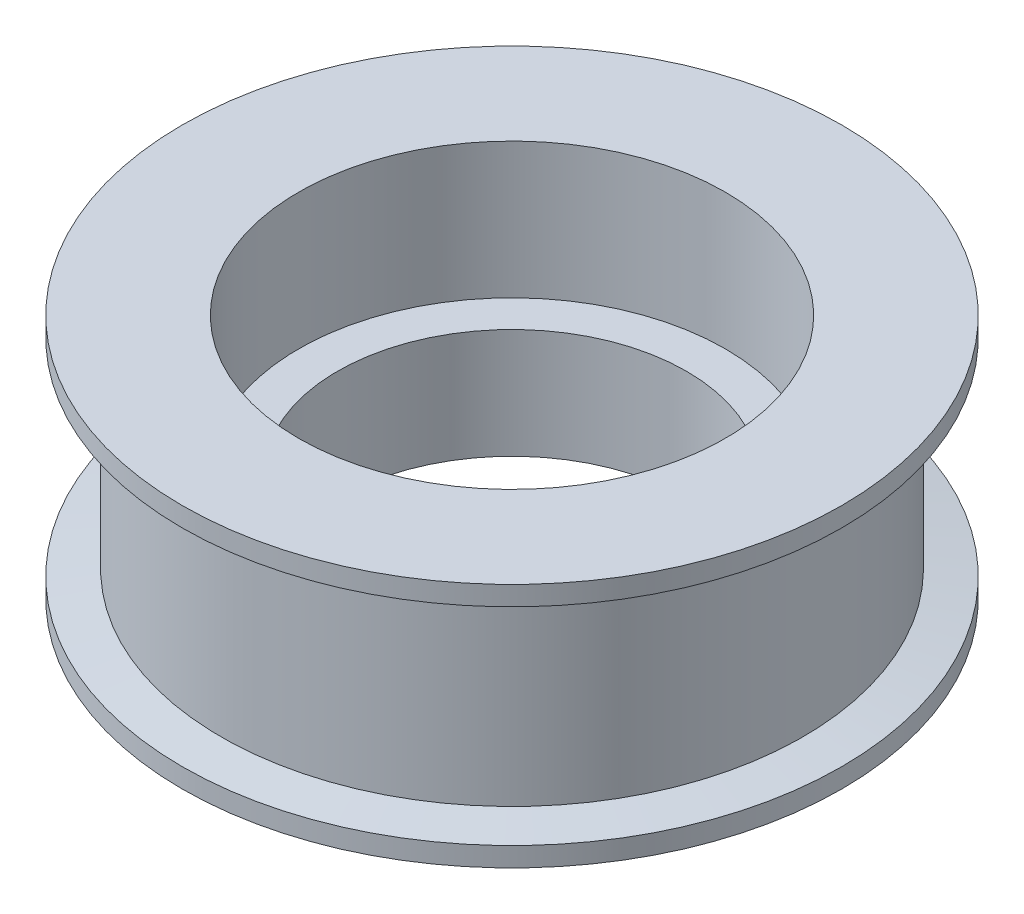
ISO-10303-21;
HEADER;
FILE_DESCRIPTION(('STEP AP214'),'2;1');
FILE_NAME('part.step','',(''),(''),'','','');
FILE_SCHEMA(('AUTOMOTIVE_DESIGN { 1 0 10303 214 1 1 1 1 }'));
ENDSEC;
DATA;
#1=APPLICATION_CONTEXT('core data for automotive mechanical design processes');
#2=APPLICATION_PROTOCOL_DEFINITION('international standard','automotive_design',2000,#1);
#3=PRODUCT_CONTEXT('',#1,'mechanical');
#4=PRODUCT('Part','Part','',(#3));
#5=PRODUCT_RELATED_PRODUCT_CATEGORY('part','',(#4));
#6=PRODUCT_DEFINITION_FORMATION('','',#4);
#7=PRODUCT_DEFINITION_CONTEXT('part definition',#1,'design');
#8=PRODUCT_DEFINITION('design','',#6,#7);
#9=PRODUCT_DEFINITION_SHAPE('','',#8);
#10=(LENGTH_UNIT() NAMED_UNIT(*) SI_UNIT(.MILLI.,.METRE.));
#11=(NAMED_UNIT(*) PLANE_ANGLE_UNIT() SI_UNIT($,.RADIAN.));
#12=(NAMED_UNIT(*) SI_UNIT($,.STERADIAN.) SOLID_ANGLE_UNIT());
#13=UNCERTAINTY_MEASURE_WITH_UNIT(LENGTH_MEASURE(1.E-05),#10,'distance_accuracy_value','');
#14=(GEOMETRIC_REPRESENTATION_CONTEXT(3) GLOBAL_UNCERTAINTY_ASSIGNED_CONTEXT((#13)) GLOBAL_UNIT_ASSIGNED_CONTEXT((#10,
#11,#12)) REPRESENTATION_CONTEXT('',''));
#15=CARTESIAN_POINT('',(0.,0.,0.));
#16=DIRECTION('',(0.,0.,1.));
#17=DIRECTION('',(1.,0.,0.));
#18=AXIS2_PLACEMENT_3D('',#15,#16,#17);
#19=CARTESIAN_POINT('',(0.,11.66,0.));
#20=DIRECTION('',(0.,1.,0.));
#21=DIRECTION('',(0.,0.,1.));
#22=AXIS2_PLACEMENT_3D('',#19,#20,#21);
#23=PLANE('',#22);
#24=CARTESIAN_POINT('',(0.,11.66,0.));
#25=DIRECTION('',(0.,1.,0.));
#26=DIRECTION('',(0.,0.,1.));
#27=AXIS2_PLACEMENT_3D('',#24,#25,#26);
#28=CIRCLE('',#27,11.);
#29=CARTESIAN_POINT('',(0.,11.66,11.));
#30=VERTEX_POINT('',#29);
#31=EDGE_CURVE('E37',#30,#30,#28,.T.);
#32=ORIENTED_EDGE('',*,*,#31,.F.);
#33=EDGE_LOOP('',(#32));
#34=FACE_BOUND('',#33,.T.);
#35=CARTESIAN_POINT('',(0.,11.66,0.));
#36=DIRECTION('',(0.,-1.,0.));
#37=DIRECTION('',(0.,0.,-1.));
#38=AXIS2_PLACEMENT_3D('',#35,#36,#37);
#39=CIRCLE('',#38,17.);
#40=CARTESIAN_POINT('',(0.,11.66,-17.));
#41=VERTEX_POINT('',#40);
#42=EDGE_CURVE('E50',#41,#41,#39,.T.);
#43=ORIENTED_EDGE('',*,*,#42,.F.);
#44=EDGE_LOOP('',(#43));
#45=FACE_BOUND('',#44,.T.);
#46=ADVANCED_FACE('F30',(#34,#45),#23,.T.);
#47=CARTESIAN_POINT('',(0.,11.66,0.));
#48=DIRECTION('',(0.,-1.,0.));
#49=DIRECTION('',(0.,0.,-1.));
#50=AXIS2_PLACEMENT_3D('',#47,#48,#49);
#51=CYLINDRICAL_SURFACE('',#50,15.);
#52=CARTESIAN_POINT('',(0.,10.33,0.));
#53=DIRECTION('',(0.,-1.,0.));
#54=DIRECTION('',(0.,0.,-1.));
#55=AXIS2_PLACEMENT_3D('',#52,#53,#54);
#56=CIRCLE('',#55,15.);
#57=CARTESIAN_POINT('',(0.,10.33,-15.));
#58=VERTEX_POINT('',#57);
#59=EDGE_CURVE('E41',#58,#58,#56,.T.);
#60=ORIENTED_EDGE('',*,*,#59,.T.);
#61=EDGE_LOOP('',(#60));
#62=FACE_BOUND('',#61,.T.);
#63=CARTESIAN_POINT('',(0.,0.33,0.));
#64=DIRECTION('',(0.,-1.,0.));
#65=DIRECTION('',(0.,0.,-1.));
#66=AXIS2_PLACEMENT_3D('',#63,#64,#65);
#67=CIRCLE('',#66,15.);
#68=CARTESIAN_POINT('',(0.,0.33,-15.));
#69=VERTEX_POINT('',#68);
#70=EDGE_CURVE('E56',#69,#69,#67,.T.);
#71=ORIENTED_EDGE('',*,*,#70,.F.);
#72=EDGE_LOOP('',(#71));
#73=FACE_BOUND('',#72,.T.);
#74=ADVANCED_FACE('F32',(#62,#73),#51,.T.);
#75=CARTESIAN_POINT('',(0.,11.66,0.));
#76=DIRECTION('',(0.,-1.,0.));
#77=DIRECTION('',(0.,0.,-1.));
#78=AXIS2_PLACEMENT_3D('',#75,#76,#77);
#79=CYLINDRICAL_SURFACE('',#78,11.);
#80=CARTESIAN_POINT('',(0.,4.66,0.));
#81=DIRECTION('',(0.,1.,0.));
#82=DIRECTION('',(0.,0.,1.));
#83=AXIS2_PLACEMENT_3D('',#80,#81,#82);
#84=CIRCLE('',#83,11.);
#85=CARTESIAN_POINT('',(0.,4.66,11.));
#86=VERTEX_POINT('',#85);
#87=EDGE_CURVE('E10',#86,#86,#84,.T.);
#88=ORIENTED_EDGE('',*,*,#87,.F.);
#89=EDGE_LOOP('',(#88));
#90=FACE_BOUND('',#89,.T.);
#91=ORIENTED_EDGE('',*,*,#31,.T.);
#92=EDGE_LOOP('',(#91));
#93=FACE_BOUND('',#92,.T.);
#94=ADVANCED_FACE('F88',(#90,#93),#79,.F.);
#95=CARTESIAN_POINT('',(0.,10.33,0.));
#96=DIRECTION('',(0.,1.,0.));
#97=DIRECTION('',(0.,0.,1.));
#98=AXIS2_PLACEMENT_3D('',#95,#96,#97);
#99=CONICAL_SURFACE('',#98,15.,1.4072697079739);
#100=CARTESIAN_POINT('',(0.,10.66,0.));
#101=DIRECTION('',(0.,-1.,0.));
#102=DIRECTION('',(0.,0.,-1.));
#103=AXIS2_PLACEMENT_3D('',#100,#101,#102);
#104=CIRCLE('',#103,17.);
#105=CARTESIAN_POINT('',(0.,10.66,-17.));
#106=VERTEX_POINT('',#105);
#107=EDGE_CURVE('E45',#106,#106,#104,.T.);
#108=ORIENTED_EDGE('',*,*,#107,.T.);
#109=EDGE_LOOP('',(#108));
#110=FACE_BOUND('',#109,.T.);
#111=ORIENTED_EDGE('',*,*,#59,.F.);
#112=EDGE_LOOP('',(#111));
#113=FACE_BOUND('',#112,.T.);
#114=ADVANCED_FACE('F94',(#110,#113),#99,.T.);
#115=CARTESIAN_POINT('',(0.,0.,0.));
#116=DIRECTION('',(0.,-1.,0.));
#117=DIRECTION('',(0.,0.,-1.));
#118=AXIS2_PLACEMENT_3D('',#115,#116,#117);
#119=CYLINDRICAL_SURFACE('',#118,17.);
#120=ORIENTED_EDGE('',*,*,#42,.T.);
#121=EDGE_LOOP('',(#120));
#122=FACE_BOUND('',#121,.T.);
#123=ORIENTED_EDGE('',*,*,#107,.F.);
#124=EDGE_LOOP('',(#123));
#125=FACE_BOUND('',#124,.T.);
#126=ADVANCED_FACE('F98',(#122,#125),#119,.T.);
#127=CARTESIAN_POINT('',(15.,4.66,0.));
#128=DIRECTION('',(0.,1.,0.));
#129=DIRECTION('',(0.,0.,1.));
#130=AXIS2_PLACEMENT_3D('',#127,#128,#129);
#131=PLANE('',#130);
#132=CARTESIAN_POINT('',(0.,4.66,0.));
#133=DIRECTION('',(0.,-1.,0.));
#134=DIRECTION('',(0.,0.,-1.));
#135=AXIS2_PLACEMENT_3D('',#132,#133,#134);
#136=CIRCLE('',#135,9.);
#137=CARTESIAN_POINT('',(0.,4.66,-9.));
#138=VERTEX_POINT('',#137);
#139=EDGE_CURVE('E53',#138,#138,#136,.T.);
#140=ORIENTED_EDGE('',*,*,#139,.T.);
#141=EDGE_LOOP('',(#140));
#142=FACE_BOUND('',#141,.T.);
#143=ORIENTED_EDGE('',*,*,#87,.T.);
#144=EDGE_LOOP('',(#143));
#145=FACE_BOUND('',#144,.T.);
#146=ADVANCED_FACE('F102',(#142,#145),#131,.T.);
#147=CARTESIAN_POINT('',(0.,0.,0.));
#148=DIRECTION('',(0.,-1.,0.));
#149=DIRECTION('',(0.,0.,-1.));
#150=AXIS2_PLACEMENT_3D('',#147,#148,#149);
#151=CYLINDRICAL_SURFACE('',#150,9.);
#152=CARTESIAN_POINT('',(0.,-1.,0.));
#153=DIRECTION('',(0.,-1.,0.));
#154=DIRECTION('',(0.,0.,-1.));
#155=AXIS2_PLACEMENT_3D('',#152,#153,#154);
#156=CIRCLE('',#155,9.);
#157=CARTESIAN_POINT('',(0.,-1.,-9.));
#158=VERTEX_POINT('',#157);
#159=EDGE_CURVE('E65',#158,#158,#156,.T.);
#160=ORIENTED_EDGE('',*,*,#159,.T.);
#161=EDGE_LOOP('',(#160));
#162=FACE_BOUND('',#161,.T.);
#163=ORIENTED_EDGE('',*,*,#139,.F.);
#164=EDGE_LOOP('',(#163));
#165=FACE_BOUND('',#164,.T.);
#166=ADVANCED_FACE('F69',(#162,#165),#151,.F.);
#167=CARTESIAN_POINT('',(0.,0.,0.));
#168=DIRECTION('',(0.,-1.,0.));
#169=DIRECTION('',(0.,0.,-1.));
#170=AXIS2_PLACEMENT_3D('',#167,#168,#169);
#171=CONICAL_SURFACE('',#170,17.,1.4072697079739);
#172=ORIENTED_EDGE('',*,*,#70,.T.);
#173=EDGE_LOOP('',(#172));
#174=FACE_BOUND('',#173,.T.);
#175=CARTESIAN_POINT('',(0.,0.,0.));
#176=DIRECTION('',(0.,-1.,0.));
#177=DIRECTION('',(0.,0.,-1.));
#178=AXIS2_PLACEMENT_3D('',#175,#176,#177);
#179=CIRCLE('',#178,17.);
#180=CARTESIAN_POINT('',(0.,0.,-17.));
#181=VERTEX_POINT('',#180);
#182=EDGE_CURVE('E59',#181,#181,#179,.T.);
#183=ORIENTED_EDGE('',*,*,#182,.F.);
#184=EDGE_LOOP('',(#183));
#185=FACE_BOUND('',#184,.T.);
#186=ADVANCED_FACE('F80',(#174,#185),#171,.T.);
#187=CARTESIAN_POINT('',(0.,0.,0.));
#188=DIRECTION('',(0.,-1.,0.));
#189=DIRECTION('',(0.,0.,-1.));
#190=AXIS2_PLACEMENT_3D('',#187,#188,#189);
#191=CYLINDRICAL_SURFACE('',#190,17.);
#192=ORIENTED_EDGE('',*,*,#182,.T.);
#193=EDGE_LOOP('',(#192));
#194=FACE_BOUND('',#193,.T.);
#195=CARTESIAN_POINT('',(0.,-0.999999999999999,0.));
#196=DIRECTION('',(0.,-1.,0.));
#197=DIRECTION('',(0.,0.,-1.));
#198=AXIS2_PLACEMENT_3D('',#195,#196,#197);
#199=CIRCLE('',#198,17.);
#200=CARTESIAN_POINT('',(0.,-0.999999999999999,-17.));
#201=VERTEX_POINT('',#200);
#202=EDGE_CURVE('E62',#201,#201,#199,.T.);
#203=ORIENTED_EDGE('',*,*,#202,.F.);
#204=EDGE_LOOP('',(#203));
#205=FACE_BOUND('',#204,.T.);
#206=ADVANCED_FACE('F74',(#194,#205),#191,.T.);
#207=CARTESIAN_POINT('',(15.,-1.,0.));
#208=DIRECTION('',(0.,-1.,0.));
#209=DIRECTION('',(0.,0.,-1.));
#210=AXIS2_PLACEMENT_3D('',#207,#208,#209);
#211=PLANE('',#210);
#212=ORIENTED_EDGE('',*,*,#202,.T.);
#213=EDGE_LOOP('',(#212));
#214=FACE_BOUND('',#213,.T.);
#215=ORIENTED_EDGE('',*,*,#159,.F.);
#216=EDGE_LOOP('',(#215));
#217=FACE_BOUND('',#216,.T.);
#218=ADVANCED_FACE('F72',(#214,#217),#211,.T.);
#219=CLOSED_SHELL('',(#46,#74,#94,#114,#126,#146,#166,#186,#206,#218));
#220=MANIFOLD_SOLID_BREP('B2',#219);
#221=ADVANCED_BREP_SHAPE_REPRESENTATION('',(#18,#220),#14);
#222=SHAPE_DEFINITION_REPRESENTATION(#9,#221);
ENDSEC;
END-ISO-10303-21;
